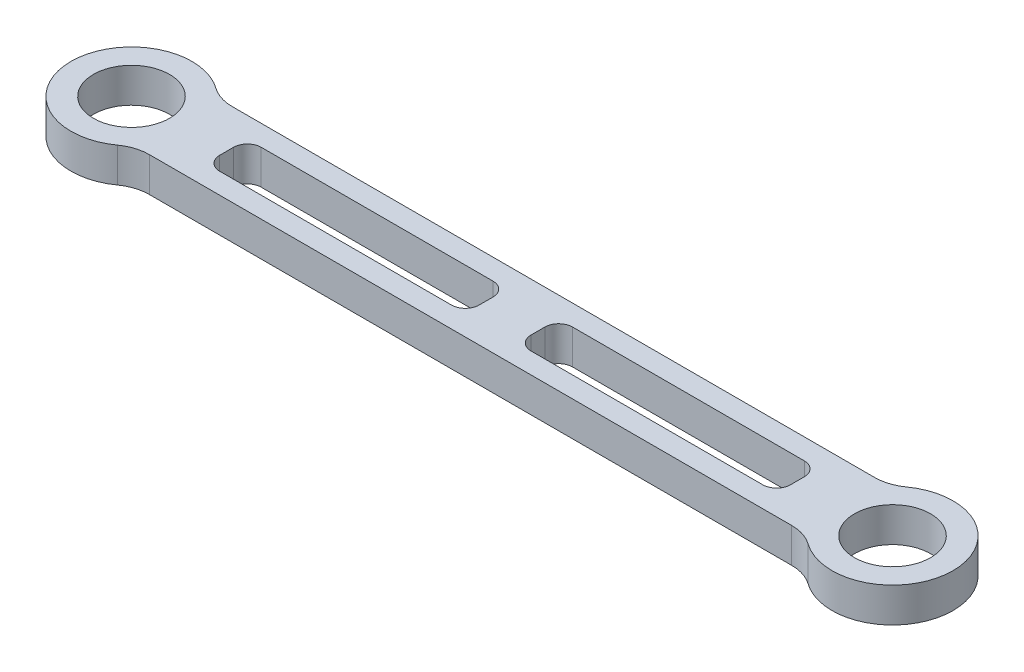
ISO-10303-21;
HEADER;
FILE_DESCRIPTION(('STEP AP214'),'2;1');
FILE_NAME('part.step','',(''),(''),'','','');
FILE_SCHEMA(('AUTOMOTIVE_DESIGN { 1 0 10303 214 1 1 1 1 }'));
ENDSEC;
DATA;
#1=APPLICATION_CONTEXT('core data for automotive mechanical design processes');
#2=APPLICATION_PROTOCOL_DEFINITION('international standard','automotive_design',2000,#1);
#3=PRODUCT_CONTEXT('',#1,'mechanical');
#4=PRODUCT('Part','Part','',(#3));
#5=PRODUCT_RELATED_PRODUCT_CATEGORY('part','',(#4));
#6=PRODUCT_DEFINITION_FORMATION('','',#4);
#7=PRODUCT_DEFINITION_CONTEXT('part definition',#1,'design');
#8=PRODUCT_DEFINITION('design','',#6,#7);
#9=PRODUCT_DEFINITION_SHAPE('','',#8);
#10=(LENGTH_UNIT() NAMED_UNIT(*) SI_UNIT(.MILLI.,.METRE.));
#11=(NAMED_UNIT(*) PLANE_ANGLE_UNIT() SI_UNIT($,.RADIAN.));
#12=(NAMED_UNIT(*) SI_UNIT($,.STERADIAN.) SOLID_ANGLE_UNIT());
#13=UNCERTAINTY_MEASURE_WITH_UNIT(LENGTH_MEASURE(1.E-05),#10,'distance_accuracy_value','');
#14=(GEOMETRIC_REPRESENTATION_CONTEXT(3) GLOBAL_UNCERTAINTY_ASSIGNED_CONTEXT((#13)) GLOBAL_UNIT_ASSIGNED_CONTEXT((#10,
#11,#12)) REPRESENTATION_CONTEXT('',''));
#15=CARTESIAN_POINT('',(0.,0.,0.));
#16=DIRECTION('',(0.,0.,1.));
#17=DIRECTION('',(1.,0.,0.));
#18=AXIS2_PLACEMENT_3D('',#15,#16,#17);
#19=CARTESIAN_POINT('',(0.,10.,-6.));
#20=DIRECTION('',(0.,0.,-1.));
#21=DIRECTION('',(-1.,0.,0.));
#22=AXIS2_PLACEMENT_3D('',#19,#20,#21);
#23=PLANE('',#22);
#24=DIRECTION('',(1.,0.,0.));
#25=VECTOR('',#24,1.);
#26=CARTESIAN_POINT('',(0.,10.,-6.));
#27=LINE('',#26,#25);
#28=CARTESIAN_POINT('',(31.5,10.,-6.));
#29=VERTEX_POINT('',#28);
#30=CARTESIAN_POINT('',(98.5,10.,-6.));
#31=VERTEX_POINT('',#30);
#32=EDGE_CURVE('E386',#29,#31,#27,.T.);
#33=ORIENTED_EDGE('',*,*,#32,.F.);
#34=DIRECTION('',(0.,-1.,0.));
#35=VECTOR('',#34,1.);
#36=CARTESIAN_POINT('',(31.5,10.,-6.));
#37=LINE('',#36,#35);
#38=CARTESIAN_POINT('',(31.5,0.,-6.));
#39=VERTEX_POINT('',#38);
#40=EDGE_CURVE('E281',#29,#39,#37,.T.);
#41=ORIENTED_EDGE('',*,*,#40,.T.);
#42=DIRECTION('',(1.,0.,0.));
#43=VECTOR('',#42,1.);
#44=CARTESIAN_POINT('',(0.,0.,-6.));
#45=LINE('',#44,#43);
#46=CARTESIAN_POINT('',(98.5,0.,-6.));
#47=VERTEX_POINT('',#46);
#48=EDGE_CURVE('E230',#39,#47,#45,.T.);
#49=ORIENTED_EDGE('',*,*,#48,.T.);
#50=DIRECTION('',(0.,-1.,0.));
#51=VECTOR('',#50,1.);
#52=CARTESIAN_POINT('',(98.5,10.,-6.));
#53=LINE('',#52,#51);
#54=EDGE_CURVE('E279',#47,#31,#53,.F.);
#55=ORIENTED_EDGE('',*,*,#54,.T.);
#56=EDGE_LOOP('',(#33,#41,#49,#55));
#57=FACE_BOUND('',#56,.T.);
#58=ADVANCED_FACE('F37',(#57),#23,.F.);
#59=CARTESIAN_POINT('',(102.5,10.,0.));
#60=DIRECTION('',(1.,0.,0.));
#61=DIRECTION('',(0.,0.,-1.));
#62=AXIS2_PLACEMENT_3D('',#59,#60,#61);
#63=PLANE('',#62);
#64=DIRECTION('',(0.,0.,1.));
#65=VECTOR('',#64,1.);
#66=CARTESIAN_POINT('',(102.5,0.,0.));
#67=LINE('',#66,#65);
#68=CARTESIAN_POINT('',(102.5,0.,-2.));
#69=VERTEX_POINT('',#68);
#70=CARTESIAN_POINT('',(102.5,0.,2.));
#71=VERTEX_POINT('',#70);
#72=EDGE_CURVE('E238',#69,#71,#67,.T.);
#73=ORIENTED_EDGE('',*,*,#72,.T.);
#74=DIRECTION('',(0.,-1.,0.));
#75=VECTOR('',#74,1.);
#76=CARTESIAN_POINT('',(102.5,10.,2.));
#77=LINE('',#76,#75);
#78=CARTESIAN_POINT('',(102.5,10.,2.));
#79=VERTEX_POINT('',#78);
#80=EDGE_CURVE('E210',#71,#79,#77,.F.);
#81=ORIENTED_EDGE('',*,*,#80,.T.);
#82=DIRECTION('',(0.,0.,1.));
#83=VECTOR('',#82,1.);
#84=CARTESIAN_POINT('',(102.5,10.,0.));
#85=LINE('',#84,#83);
#86=CARTESIAN_POINT('',(102.5,10.,-2.));
#87=VERTEX_POINT('',#86);
#88=EDGE_CURVE('E389',#87,#79,#85,.T.);
#89=ORIENTED_EDGE('',*,*,#88,.F.);
#90=DIRECTION('',(0.,-1.,0.));
#91=VECTOR('',#90,1.);
#92=CARTESIAN_POINT('',(102.5,0.,-2.));
#93=LINE('',#92,#91);
#94=EDGE_CURVE('E284',#87,#69,#93,.T.);
#95=ORIENTED_EDGE('',*,*,#94,.T.);
#96=EDGE_LOOP('',(#73,#81,#89,#95));
#97=FACE_BOUND('',#96,.T.);
#98=ADVANCED_FACE('F434',(#97),#63,.F.);
#99=CARTESIAN_POINT('',(0.,10.,6.));
#100=DIRECTION('',(0.,0.,-1.));
#101=DIRECTION('',(-1.,0.,0.));
#102=AXIS2_PLACEMENT_3D('',#99,#100,#101);
#103=PLANE('',#102);
#104=DIRECTION('',(1.,0.,0.));
#105=VECTOR('',#104,1.);
#106=CARTESIAN_POINT('',(0.,0.,6.));
#107=LINE('',#106,#105);
#108=CARTESIAN_POINT('',(31.5,0.,6.));
#109=VERTEX_POINT('',#108);
#110=CARTESIAN_POINT('',(98.5,0.,6.));
#111=VERTEX_POINT('',#110);
#112=EDGE_CURVE('E241',#109,#111,#107,.T.);
#113=ORIENTED_EDGE('',*,*,#112,.F.);
#114=DIRECTION('',(0.,-1.,0.));
#115=VECTOR('',#114,1.);
#116=CARTESIAN_POINT('',(31.5,10.,6.));
#117=LINE('',#116,#115);
#118=CARTESIAN_POINT('',(31.5,10.,6.));
#119=VERTEX_POINT('',#118);
#120=EDGE_CURVE('E277',#109,#119,#117,.F.);
#121=ORIENTED_EDGE('',*,*,#120,.T.);
#122=DIRECTION('',(1.,0.,0.));
#123=VECTOR('',#122,1.);
#124=CARTESIAN_POINT('',(0.,10.,6.));
#125=LINE('',#124,#123);
#126=CARTESIAN_POINT('',(98.5,10.,6.));
#127=VERTEX_POINT('',#126);
#128=EDGE_CURVE('E392',#119,#127,#125,.T.);
#129=ORIENTED_EDGE('',*,*,#128,.T.);
#130=DIRECTION('',(0.,-1.,0.));
#131=VECTOR('',#130,1.);
#132=CARTESIAN_POINT('',(98.5,10.,6.));
#133=LINE('',#132,#131);
#134=EDGE_CURVE('E274',#127,#111,#133,.T.);
#135=ORIENTED_EDGE('',*,*,#134,.T.);
#136=EDGE_LOOP('',(#113,#121,#129,#135));
#137=FACE_BOUND('',#136,.T.);
#138=ADVANCED_FACE('F431',(#137),#103,.T.);
#139=CARTESIAN_POINT('',(0.,10.,-6.));
#140=DIRECTION('',(0.,0.,1.));
#141=DIRECTION('',(1.,0.,0.));
#142=AXIS2_PLACEMENT_3D('',#139,#140,#141);
#143=PLANE('',#142);
#144=DIRECTION('',(-1.,0.,0.));
#145=VECTOR('',#144,1.);
#146=CARTESIAN_POINT('',(0.,0.,-6.));
#147=LINE('',#146,#145);
#148=CARTESIAN_POINT('',(188.5,0.,-6.));
#149=VERTEX_POINT('',#148);
#150=CARTESIAN_POINT('',(121.5,0.,-6.));
#151=VERTEX_POINT('',#150);
#152=EDGE_CURVE('E232',#149,#151,#147,.T.);
#153=ORIENTED_EDGE('',*,*,#152,.F.);
#154=DIRECTION('',(0.,-1.,0.));
#155=VECTOR('',#154,1.);
#156=CARTESIAN_POINT('',(188.5,10.,-6.));
#157=LINE('',#156,#155);
#158=CARTESIAN_POINT('',(188.5,10.,-6.));
#159=VERTEX_POINT('',#158);
#160=EDGE_CURVE('E262',#149,#159,#157,.F.);
#161=ORIENTED_EDGE('',*,*,#160,.T.);
#162=DIRECTION('',(-1.,0.,0.));
#163=VECTOR('',#162,1.);
#164=CARTESIAN_POINT('',(0.,10.,-6.));
#165=LINE('',#164,#163);
#166=CARTESIAN_POINT('',(121.5,10.,-6.));
#167=VERTEX_POINT('',#166);
#168=EDGE_CURVE('E376',#159,#167,#165,.T.);
#169=ORIENTED_EDGE('',*,*,#168,.T.);
#170=DIRECTION('',(0.,-1.,0.));
#171=VECTOR('',#170,1.);
#172=CARTESIAN_POINT('',(121.5,0.,-6.));
#173=LINE('',#172,#171);
#174=EDGE_CURVE('E259',#167,#151,#173,.T.);
#175=ORIENTED_EDGE('',*,*,#174,.T.);
#176=EDGE_LOOP('',(#153,#161,#169,#175));
#177=FACE_BOUND('',#176,.T.);
#178=ADVANCED_FACE('F413',(#177),#143,.T.);
#179=CARTESIAN_POINT('',(192.5,10.,0.));
#180=DIRECTION('',(1.,0.,0.));
#181=DIRECTION('',(0.,0.,-1.));
#182=AXIS2_PLACEMENT_3D('',#179,#180,#181);
#183=PLANE('',#182);
#184=DIRECTION('',(0.,0.,1.));
#185=VECTOR('',#184,1.);
#186=CARTESIAN_POINT('',(192.5,0.,0.));
#187=LINE('',#186,#185);
#188=CARTESIAN_POINT('',(192.5,0.,-2.));
#189=VERTEX_POINT('',#188);
#190=CARTESIAN_POINT('',(192.5,0.,2.));
#191=VERTEX_POINT('',#190);
#192=EDGE_CURVE('E228',#189,#191,#187,.T.);
#193=ORIENTED_EDGE('',*,*,#192,.T.);
#194=DIRECTION('',(0.,-1.,0.));
#195=VECTOR('',#194,1.);
#196=CARTESIAN_POINT('',(192.5,10.,2.));
#197=LINE('',#196,#195);
#198=CARTESIAN_POINT('',(192.5,10.,2.));
#199=VERTEX_POINT('',#198);
#200=EDGE_CURVE('E204',#191,#199,#197,.F.);
#201=ORIENTED_EDGE('',*,*,#200,.T.);
#202=DIRECTION('',(0.,0.,1.));
#203=VECTOR('',#202,1.);
#204=CARTESIAN_POINT('',(192.5,10.,0.));
#205=LINE('',#204,#203);
#206=CARTESIAN_POINT('',(192.5,10.,-2.));
#207=VERTEX_POINT('',#206);
#208=EDGE_CURVE('E379',#207,#199,#205,.T.);
#209=ORIENTED_EDGE('',*,*,#208,.F.);
#210=DIRECTION('',(0.,-1.,0.));
#211=VECTOR('',#210,1.);
#212=CARTESIAN_POINT('',(192.5,10.,-2.));
#213=LINE('',#212,#211);
#214=EDGE_CURVE('E220',#207,#189,#213,.T.);
#215=ORIENTED_EDGE('',*,*,#214,.T.);
#216=EDGE_LOOP('',(#193,#201,#209,#215));
#217=FACE_BOUND('',#216,.T.);
#218=ADVANCED_FACE('F423',(#217),#183,.F.);
#219=CARTESIAN_POINT('',(0.,10.,6.));
#220=DIRECTION('',(0.,0.,1.));
#221=DIRECTION('',(1.,0.,0.));
#222=AXIS2_PLACEMENT_3D('',#219,#220,#221);
#223=PLANE('',#222);
#224=DIRECTION('',(-1.,0.,0.));
#225=VECTOR('',#224,1.);
#226=CARTESIAN_POINT('',(0.,10.,6.));
#227=LINE('',#226,#225);
#228=CARTESIAN_POINT('',(188.5,10.,6.));
#229=VERTEX_POINT('',#228);
#230=CARTESIAN_POINT('',(121.5,10.,6.));
#231=VERTEX_POINT('',#230);
#232=EDGE_CURVE('E219',#229,#231,#227,.T.);
#233=ORIENTED_EDGE('',*,*,#232,.F.);
#234=DIRECTION('',(0.,-1.,0.));
#235=VECTOR('',#234,1.);
#236=CARTESIAN_POINT('',(188.5,0.,6.));
#237=LINE('',#236,#235);
#238=CARTESIAN_POINT('',(188.5,0.,6.));
#239=VERTEX_POINT('',#238);
#240=EDGE_CURVE('E203',#229,#239,#237,.T.);
#241=ORIENTED_EDGE('',*,*,#240,.T.);
#242=DIRECTION('',(-1.,0.,0.));
#243=VECTOR('',#242,1.);
#244=CARTESIAN_POINT('',(0.,0.,6.));
#245=LINE('',#244,#243);
#246=CARTESIAN_POINT('',(121.5,0.,6.));
#247=VERTEX_POINT('',#246);
#248=EDGE_CURVE('E216',#239,#247,#245,.T.);
#249=ORIENTED_EDGE('',*,*,#248,.T.);
#250=DIRECTION('',(0.,-1.,0.));
#251=VECTOR('',#250,1.);
#252=CARTESIAN_POINT('',(121.5,10.,6.));
#253=LINE('',#252,#251);
#254=EDGE_CURVE('E221',#247,#231,#253,.F.);
#255=ORIENTED_EDGE('',*,*,#254,.T.);
#256=EDGE_LOOP('',(#233,#241,#249,#255));
#257=FACE_BOUND('',#256,.T.);
#258=ADVANCED_FACE('F215',(#257),#223,.F.);
#259=CARTESIAN_POINT('',(0.,10.,12.));
#260=DIRECTION('',(0.,0.,-1.));
#261=DIRECTION('',(-1.,0.,0.));
#262=AXIS2_PLACEMENT_3D('',#259,#260,#261);
#263=PLANE('',#262);
#264=DIRECTION('',(1.,0.,0.));
#265=VECTOR('',#264,1.);
#266=CARTESIAN_POINT('',(0.,0.,12.));
#267=LINE('',#266,#265);
#268=CARTESIAN_POINT('',(17.1537167984085,0.,12.));
#269=VERTEX_POINT('',#268);
#270=CARTESIAN_POINT('',(202.846283201592,0.,12.));
#271=VERTEX_POINT('',#270);
#272=EDGE_CURVE('E350',#269,#271,#267,.T.);
#273=ORIENTED_EDGE('',*,*,#272,.T.);
#274=DIRECTION('',(0.,1.,0.));
#275=VECTOR('',#274,1.);
#276=CARTESIAN_POINT('',(202.846283201592,10.,12.));
#277=LINE('',#276,#275);
#278=CARTESIAN_POINT('',(202.846283201592,10.,12.));
#279=VERTEX_POINT('',#278);
#280=EDGE_CURVE('E329',#271,#279,#277,.T.);
#281=ORIENTED_EDGE('',*,*,#280,.T.);
#282=DIRECTION('',(1.,0.,0.));
#283=VECTOR('',#282,1.);
#284=CARTESIAN_POINT('',(0.,10.,12.));
#285=LINE('',#284,#283);
#286=CARTESIAN_POINT('',(17.1537167984085,10.,12.));
#287=VERTEX_POINT('',#286);
#288=EDGE_CURVE('E253',#287,#279,#285,.T.);
#289=ORIENTED_EDGE('',*,*,#288,.F.);
#290=DIRECTION('',(0.,1.,0.));
#291=VECTOR('',#290,1.);
#292=CARTESIAN_POINT('',(17.1537167984085,0.,12.));
#293=LINE('',#292,#291);
#294=EDGE_CURVE('E326',#287,#269,#293,.F.);
#295=ORIENTED_EDGE('',*,*,#294,.T.);
#296=EDGE_LOOP('',(#273,#281,#289,#295));
#297=FACE_BOUND('',#296,.T.);
#298=ADVANCED_FACE('F365',(#297),#263,.F.);
#299=CARTESIAN_POINT('',(220.,10.,0.));
#300=DIRECTION('',(0.,-1.,0.));
#301=DIRECTION('',(0.,0.,-1.));
#302=AXIS2_PLACEMENT_3D('',#299,#300,#301);
#303=CYLINDRICAL_SURFACE('',#302,17.5);
#304=CARTESIAN_POINT('',(220.,0.,0.));
#305=DIRECTION('',(0.,1.,0.));
#306=DIRECTION('',(0.,0.,1.));
#307=AXIS2_PLACEMENT_3D('',#304,#305,#306);
#308=CIRCLE('',#307,17.5);
#309=CARTESIAN_POINT('',(209.824066306029,0.,14.2372881355932));
#310=VERTEX_POINT('',#309);
#311=CARTESIAN_POINT('',(209.824066306029,0.,-14.2372881355932));
#312=VERTEX_POINT('',#311);
#313=EDGE_CURVE('E404',#310,#312,#308,.T.);
#314=ORIENTED_EDGE('',*,*,#313,.T.);
#315=DIRECTION('',(0.,-1.,0.));
#316=VECTOR('',#315,1.);
#317=CARTESIAN_POINT('',(209.824066306029,10.,-14.2372881355932));
#318=LINE('',#317,#316);
#319=CARTESIAN_POINT('',(209.824066306029,10.,-14.2372881355932));
#320=VERTEX_POINT('',#319);
#321=EDGE_CURVE('E324',#312,#320,#318,.F.);
#322=ORIENTED_EDGE('',*,*,#321,.T.);
#323=CARTESIAN_POINT('',(220.,10.,0.));
#324=DIRECTION('',(0.,1.,0.));
#325=DIRECTION('',(0.,0.,1.));
#326=AXIS2_PLACEMENT_3D('',#323,#324,#325);
#327=CIRCLE('',#326,17.5);
#328=CARTESIAN_POINT('',(209.824066306029,10.,14.2372881355932));
#329=VERTEX_POINT('',#328);
#330=EDGE_CURVE('E367',#329,#320,#327,.T.);
#331=ORIENTED_EDGE('',*,*,#330,.F.);
#332=DIRECTION('',(0.,-1.,0.));
#333=VECTOR('',#332,1.);
#334=CARTESIAN_POINT('',(209.824066306029,10.,14.2372881355932));
#335=LINE('',#334,#333);
#336=EDGE_CURVE('E321',#329,#310,#335,.T.);
#337=ORIENTED_EDGE('',*,*,#336,.T.);
#338=EDGE_LOOP('',(#314,#322,#331,#337));
#339=FACE_BOUND('',#338,.T.);
#340=ADVANCED_FACE('F515',(#339),#303,.T.);
#341=CARTESIAN_POINT('',(0.,10.,-12.));
#342=DIRECTION('',(0.,0.,-1.));
#343=DIRECTION('',(-1.,0.,0.));
#344=AXIS2_PLACEMENT_3D('',#341,#342,#343);
#345=PLANE('',#344);
#346=DIRECTION('',(1.,0.,0.));
#347=VECTOR('',#346,1.);
#348=CARTESIAN_POINT('',(0.,10.,-12.));
#349=LINE('',#348,#347);
#350=CARTESIAN_POINT('',(17.1537167984085,10.,-12.));
#351=VERTEX_POINT('',#350);
#352=CARTESIAN_POINT('',(202.846283201592,10.,-12.));
#353=VERTEX_POINT('',#352);
#354=EDGE_CURVE('E370',#351,#353,#349,.T.);
#355=ORIENTED_EDGE('',*,*,#354,.T.);
#356=DIRECTION('',(0.,-1.,0.));
#357=VECTOR('',#356,1.);
#358=CARTESIAN_POINT('',(202.846283201592,10.,-12.));
#359=LINE('',#358,#357);
#360=CARTESIAN_POINT('',(202.846283201592,0.,-12.));
#361=VERTEX_POINT('',#360);
#362=EDGE_CURVE('E318',#353,#361,#359,.T.);
#363=ORIENTED_EDGE('',*,*,#362,.T.);
#364=DIRECTION('',(1.,0.,0.));
#365=VECTOR('',#364,1.);
#366=CARTESIAN_POINT('',(0.,0.,-12.));
#367=LINE('',#366,#365);
#368=CARTESIAN_POINT('',(17.1537167984085,0.,-12.));
#369=VERTEX_POINT('',#368);
#370=EDGE_CURVE('E355',#369,#361,#367,.T.);
#371=ORIENTED_EDGE('',*,*,#370,.F.);
#372=DIRECTION('',(0.,-1.,0.));
#373=VECTOR('',#372,1.);
#374=CARTESIAN_POINT('',(17.1537167984085,10.,-12.));
#375=LINE('',#374,#373);
#376=EDGE_CURVE('E316',#369,#351,#375,.F.);
#377=ORIENTED_EDGE('',*,*,#376,.T.);
#378=EDGE_LOOP('',(#355,#363,#371,#377));
#379=FACE_BOUND('',#378,.T.);
#380=ADVANCED_FACE('F509',(#379),#345,.T.);
#381=CARTESIAN_POINT('',(0.,10.,0.));
#382=DIRECTION('',(0.,-1.,0.));
#383=DIRECTION('',(0.,0.,-1.));
#384=AXIS2_PLACEMENT_3D('',#381,#382,#383);
#385=CYLINDRICAL_SURFACE('',#384,11.);
#386=CARTESIAN_POINT('',(0.,10.,0.));
#387=DIRECTION('',(0.,1.,0.));
#388=DIRECTION('',(0.,0.,1.));
#389=AXIS2_PLACEMENT_3D('',#386,#387,#388);
#390=CIRCLE('',#389,11.);
#391=CARTESIAN_POINT('',(0.,10.,11.));
#392=VERTEX_POINT('',#391);
#393=EDGE_CURVE('E398',#392,#392,#390,.T.);
#394=ORIENTED_EDGE('',*,*,#393,.T.);
#395=EDGE_LOOP('',(#394));
#396=FACE_BOUND('',#395,.T.);
#397=CARTESIAN_POINT('',(0.,0.,0.));
#398=DIRECTION('',(0.,1.,0.));
#399=DIRECTION('',(0.,0.,1.));
#400=AXIS2_PLACEMENT_3D('',#397,#398,#399);
#401=CIRCLE('',#400,11.);
#402=CARTESIAN_POINT('',(0.,0.,11.));
#403=VERTEX_POINT('',#402);
#404=EDGE_CURVE('E247',#403,#403,#401,.T.);
#405=ORIENTED_EDGE('',*,*,#404,.F.);
#406=EDGE_LOOP('',(#405));
#407=FACE_BOUND('',#406,.T.);
#408=ADVANCED_FACE('F455',(#396,#407),#385,.F.);
#409=CARTESIAN_POINT('',(27.5,10.,0.));
#410=DIRECTION('',(1.,0.,0.));
#411=DIRECTION('',(0.,0.,-1.));
#412=AXIS2_PLACEMENT_3D('',#409,#410,#411);
#413=PLANE('',#412);
#414=DIRECTION('',(0.,0.,1.));
#415=VECTOR('',#414,1.);
#416=CARTESIAN_POINT('',(27.5,10.,0.));
#417=LINE('',#416,#415);
#418=CARTESIAN_POINT('',(27.5,10.,-2.));
#419=VERTEX_POINT('',#418);
#420=CARTESIAN_POINT('',(27.5,10.,2.));
#421=VERTEX_POINT('',#420);
#422=EDGE_CURVE('E395',#419,#421,#417,.T.);
#423=ORIENTED_EDGE('',*,*,#422,.T.);
#424=DIRECTION('',(0.,-1.,0.));
#425=VECTOR('',#424,1.);
#426=CARTESIAN_POINT('',(27.5,0.,2.));
#427=LINE('',#426,#425);
#428=CARTESIAN_POINT('',(27.5,0.,2.));
#429=VERTEX_POINT('',#428);
#430=EDGE_CURVE('E271',#421,#429,#427,.T.);
#431=ORIENTED_EDGE('',*,*,#430,.T.);
#432=DIRECTION('',(0.,0.,1.));
#433=VECTOR('',#432,1.);
#434=CARTESIAN_POINT('',(27.5,0.,0.));
#435=LINE('',#434,#433);
#436=CARTESIAN_POINT('',(27.5,0.,-2.));
#437=VERTEX_POINT('',#436);
#438=EDGE_CURVE('E244',#437,#429,#435,.T.);
#439=ORIENTED_EDGE('',*,*,#438,.F.);
#440=DIRECTION('',(0.,-1.,0.));
#441=VECTOR('',#440,1.);
#442=CARTESIAN_POINT('',(27.5,10.,-2.));
#443=LINE('',#442,#441);
#444=EDGE_CURVE('E269',#437,#419,#443,.F.);
#445=ORIENTED_EDGE('',*,*,#444,.T.);
#446=EDGE_LOOP('',(#423,#431,#439,#445));
#447=FACE_BOUND('',#446,.T.);
#448=ADVANCED_FACE('F447',(#447),#413,.T.);
#449=CARTESIAN_POINT('',(117.5,10.,0.));
#450=DIRECTION('',(1.,0.,0.));
#451=DIRECTION('',(0.,0.,-1.));
#452=AXIS2_PLACEMENT_3D('',#449,#450,#451);
#453=PLANE('',#452);
#454=DIRECTION('',(0.,0.,1.));
#455=VECTOR('',#454,1.);
#456=CARTESIAN_POINT('',(117.5,10.,0.));
#457=LINE('',#456,#455);
#458=CARTESIAN_POINT('',(117.5,10.,-2.));
#459=VERTEX_POINT('',#458);
#460=CARTESIAN_POINT('',(117.5,10.,2.));
#461=VERTEX_POINT('',#460);
#462=EDGE_CURVE('E383',#459,#461,#457,.T.);
#463=ORIENTED_EDGE('',*,*,#462,.T.);
#464=DIRECTION('',(0.,-1.,0.));
#465=VECTOR('',#464,1.);
#466=CARTESIAN_POINT('',(117.5,10.,2.));
#467=LINE('',#466,#465);
#468=CARTESIAN_POINT('',(117.5,0.,2.));
#469=VERTEX_POINT('',#468);
#470=EDGE_CURVE('E266',#461,#469,#467,.T.);
#471=ORIENTED_EDGE('',*,*,#470,.T.);
#472=DIRECTION('',(0.,0.,1.));
#473=VECTOR('',#472,1.);
#474=CARTESIAN_POINT('',(117.5,0.,0.));
#475=LINE('',#474,#473);
#476=CARTESIAN_POINT('',(117.5,0.,-2.));
#477=VERTEX_POINT('',#476);
#478=EDGE_CURVE('E227',#477,#469,#475,.T.);
#479=ORIENTED_EDGE('',*,*,#478,.F.);
#480=DIRECTION('',(0.,-1.,0.));
#481=VECTOR('',#480,1.);
#482=CARTESIAN_POINT('',(117.5,10.,-2.));
#483=LINE('',#482,#481);
#484=EDGE_CURVE('E264',#477,#459,#483,.F.);
#485=ORIENTED_EDGE('',*,*,#484,.T.);
#486=EDGE_LOOP('',(#463,#471,#479,#485));
#487=FACE_BOUND('',#486,.T.);
#488=ADVANCED_FACE('F445',(#487),#453,.T.);
#489=CARTESIAN_POINT('',(0.,10.,0.));
#490=DIRECTION('',(0.,-1.,0.));
#491=DIRECTION('',(0.,0.,-1.));
#492=AXIS2_PLACEMENT_3D('',#489,#490,#491);
#493=CYLINDRICAL_SURFACE('',#492,17.5);
#494=CARTESIAN_POINT('',(0.,10.,0.));
#495=DIRECTION('',(0.,1.,0.));
#496=DIRECTION('',(0.,0.,1.));
#497=AXIS2_PLACEMENT_3D('',#494,#495,#496);
#498=CIRCLE('',#497,17.5);
#499=CARTESIAN_POINT('',(10.1759336939711,10.,-14.2372881355932));
#500=VERTEX_POINT('',#499);
#501=CARTESIAN_POINT('',(10.1759336939711,10.,14.2372881355932));
#502=VERTEX_POINT('',#501);
#503=EDGE_CURVE('E363',#500,#502,#498,.T.);
#504=ORIENTED_EDGE('',*,*,#503,.F.);
#505=DIRECTION('',(0.,-1.,0.));
#506=VECTOR('',#505,1.);
#507=CARTESIAN_POINT('',(10.1759336939711,10.,-14.2372881355932));
#508=LINE('',#507,#506);
#509=CARTESIAN_POINT('',(10.1759336939711,0.,-14.2372881355932));
#510=VERTEX_POINT('',#509);
#511=EDGE_CURVE('E332',#500,#510,#508,.T.);
#512=ORIENTED_EDGE('',*,*,#511,.T.);
#513=CARTESIAN_POINT('',(0.,0.,0.));
#514=DIRECTION('',(0.,1.,0.));
#515=DIRECTION('',(0.,0.,1.));
#516=AXIS2_PLACEMENT_3D('',#513,#514,#515);
#517=CIRCLE('',#516,17.5);
#518=CARTESIAN_POINT('',(10.1759336939711,0.,14.2372881355932));
#519=VERTEX_POINT('',#518);
#520=EDGE_CURVE('E348',#510,#519,#517,.T.);
#521=ORIENTED_EDGE('',*,*,#520,.T.);
#522=DIRECTION('',(0.,-1.,0.));
#523=VECTOR('',#522,1.);
#524=CARTESIAN_POINT('',(10.1759336939711,10.,14.2372881355932));
#525=LINE('',#524,#523);
#526=EDGE_CURVE('E52',#519,#502,#525,.F.);
#527=ORIENTED_EDGE('',*,*,#526,.T.);
#528=EDGE_LOOP('',(#504,#512,#521,#527));
#529=FACE_BOUND('',#528,.T.);
#530=ADVANCED_FACE('F353',(#529),#493,.T.);
#531=CARTESIAN_POINT('',(220.,10.,0.));
#532=DIRECTION('',(0.,-1.,0.));
#533=DIRECTION('',(0.,0.,-1.));
#534=AXIS2_PLACEMENT_3D('',#531,#532,#533);
#535=CYLINDRICAL_SURFACE('',#534,11.);
#536=CARTESIAN_POINT('',(220.,10.,0.));
#537=DIRECTION('',(0.,1.,0.));
#538=DIRECTION('',(0.,0.,1.));
#539=AXIS2_PLACEMENT_3D('',#536,#537,#538);
#540=CIRCLE('',#539,11.);
#541=CARTESIAN_POINT('',(220.,10.,11.));
#542=VERTEX_POINT('',#541);
#543=EDGE_CURVE('E254',#542,#542,#540,.T.);
#544=ORIENTED_EDGE('',*,*,#543,.T.);
#545=EDGE_LOOP('',(#544));
#546=FACE_BOUND('',#545,.T.);
#547=CARTESIAN_POINT('',(220.,0.,0.));
#548=DIRECTION('',(0.,1.,0.));
#549=DIRECTION('',(0.,0.,1.));
#550=AXIS2_PLACEMENT_3D('',#547,#548,#549);
#551=CIRCLE('',#550,11.);
#552=CARTESIAN_POINT('',(220.,0.,11.));
#553=VERTEX_POINT('',#552);
#554=EDGE_CURVE('E250',#553,#553,#551,.T.);
#555=ORIENTED_EDGE('',*,*,#554,.F.);
#556=EDGE_LOOP('',(#555));
#557=FACE_BOUND('',#556,.T.);
#558=ADVANCED_FACE('F453',(#546,#557),#535,.F.);
#559=CARTESIAN_POINT('',(0.,10.,0.));
#560=DIRECTION('',(0.,1.,0.));
#561=DIRECTION('',(0.,0.,1.));
#562=AXIS2_PLACEMENT_3D('',#559,#560,#561);
#563=PLANE('',#562);
#564=ORIENTED_EDGE('',*,*,#503,.T.);
#565=CARTESIAN_POINT('',(17.1537167984085,10.,24.));
#566=DIRECTION('',(0.,1.,0.));
#567=DIRECTION('',(0.,0.,1.));
#568=AXIS2_PLACEMENT_3D('',#565,#566,#567);
#569=CIRCLE('',#568,12.);
#570=EDGE_CURVE('E11',#502,#287,#569,.F.);
#571=ORIENTED_EDGE('',*,*,#570,.T.);
#572=ORIENTED_EDGE('',*,*,#288,.T.);
#573=CARTESIAN_POINT('',(202.846283201592,10.,24.));
#574=DIRECTION('',(0.,1.,0.));
#575=DIRECTION('',(0.,0.,1.));
#576=AXIS2_PLACEMENT_3D('',#573,#574,#575);
#577=CIRCLE('',#576,12.);
#578=EDGE_CURVE('E341',#279,#329,#577,.F.);
#579=ORIENTED_EDGE('',*,*,#578,.T.);
#580=ORIENTED_EDGE('',*,*,#330,.T.);
#581=CARTESIAN_POINT('',(202.846283201592,10.,-24.));
#582=DIRECTION('',(0.,1.,0.));
#583=DIRECTION('',(0.,0.,1.));
#584=AXIS2_PLACEMENT_3D('',#581,#582,#583);
#585=CIRCLE('',#584,12.);
#586=EDGE_CURVE('E337',#320,#353,#585,.F.);
#587=ORIENTED_EDGE('',*,*,#586,.T.);
#588=ORIENTED_EDGE('',*,*,#354,.F.);
#589=CARTESIAN_POINT('',(17.1537167984085,10.,-24.));
#590=DIRECTION('',(0.,1.,0.));
#591=DIRECTION('',(0.,0.,1.));
#592=AXIS2_PLACEMENT_3D('',#589,#590,#591);
#593=CIRCLE('',#592,12.);
#594=EDGE_CURVE('E59',#351,#500,#593,.F.);
#595=ORIENTED_EDGE('',*,*,#594,.T.);
#596=EDGE_LOOP('',(#564,#571,#572,#579,#580,#587,#588,#595));
#597=FACE_BOUND('',#596,.T.);
#598=ORIENTED_EDGE('',*,*,#168,.F.);
#599=CARTESIAN_POINT('',(188.5,10.,-2.));
#600=DIRECTION('',(0.,1.,0.));
#601=DIRECTION('',(0.,0.,1.));
#602=AXIS2_PLACEMENT_3D('',#599,#600,#601);
#603=CIRCLE('',#602,4.);
#604=EDGE_CURVE('E291',#159,#207,#603,.F.);
#605=ORIENTED_EDGE('',*,*,#604,.T.);
#606=ORIENTED_EDGE('',*,*,#208,.T.);
#607=CARTESIAN_POINT('',(188.5,10.,2.));
#608=DIRECTION('',(0.,1.,0.));
#609=DIRECTION('',(0.,0.,1.));
#610=AXIS2_PLACEMENT_3D('',#607,#608,#609);
#611=CIRCLE('',#610,4.);
#612=EDGE_CURVE('E209',#199,#229,#611,.F.);
#613=ORIENTED_EDGE('',*,*,#612,.T.);
#614=ORIENTED_EDGE('',*,*,#232,.T.);
#615=CARTESIAN_POINT('',(121.5,10.,2.));
#616=DIRECTION('',(0.,1.,0.));
#617=DIRECTION('',(0.,0.,1.));
#618=AXIS2_PLACEMENT_3D('',#615,#616,#617);
#619=CIRCLE('',#618,4.);
#620=EDGE_CURVE('E294',#231,#461,#619,.F.);
#621=ORIENTED_EDGE('',*,*,#620,.T.);
#622=ORIENTED_EDGE('',*,*,#462,.F.);
#623=CARTESIAN_POINT('',(121.5,10.,-2.));
#624=DIRECTION('',(0.,1.,0.));
#625=DIRECTION('',(0.,0.,1.));
#626=AXIS2_PLACEMENT_3D('',#623,#624,#625);
#627=CIRCLE('',#626,4.);
#628=EDGE_CURVE('E298',#459,#167,#627,.F.);
#629=ORIENTED_EDGE('',*,*,#628,.T.);
#630=EDGE_LOOP('',(#598,#605,#606,#613,#614,#621,#622,#629));
#631=FACE_BOUND('',#630,.T.);
#632=ORIENTED_EDGE('',*,*,#422,.F.);
#633=CARTESIAN_POINT('',(31.5,10.,-2.));
#634=DIRECTION('',(0.,1.,0.));
#635=DIRECTION('',(0.,0.,1.));
#636=AXIS2_PLACEMENT_3D('',#633,#634,#635);
#637=CIRCLE('',#636,4.);
#638=EDGE_CURVE('E306',#419,#29,#637,.F.);
#639=ORIENTED_EDGE('',*,*,#638,.T.);
#640=ORIENTED_EDGE('',*,*,#32,.T.);
#641=CARTESIAN_POINT('',(98.5,10.,-2.));
#642=DIRECTION('',(0.,1.,0.));
#643=DIRECTION('',(0.,0.,1.));
#644=AXIS2_PLACEMENT_3D('',#641,#642,#643);
#645=CIRCLE('',#644,4.);
#646=EDGE_CURVE('E314',#31,#87,#645,.F.);
#647=ORIENTED_EDGE('',*,*,#646,.T.);
#648=ORIENTED_EDGE('',*,*,#88,.T.);
#649=CARTESIAN_POINT('',(98.5,10.,2.));
#650=DIRECTION('',(0.,1.,0.));
#651=DIRECTION('',(0.,0.,1.));
#652=AXIS2_PLACEMENT_3D('',#649,#650,#651);
#653=CIRCLE('',#652,4.);
#654=EDGE_CURVE('E310',#79,#127,#653,.F.);
#655=ORIENTED_EDGE('',*,*,#654,.T.);
#656=ORIENTED_EDGE('',*,*,#128,.F.);
#657=CARTESIAN_POINT('',(31.5,10.,2.));
#658=DIRECTION('',(0.,1.,0.));
#659=DIRECTION('',(0.,0.,1.));
#660=AXIS2_PLACEMENT_3D('',#657,#658,#659);
#661=CIRCLE('',#660,4.);
#662=EDGE_CURVE('E302',#119,#421,#661,.F.);
#663=ORIENTED_EDGE('',*,*,#662,.T.);
#664=EDGE_LOOP('',(#632,#639,#640,#647,#648,#655,#656,#663));
#665=FACE_BOUND('',#664,.T.);
#666=ORIENTED_EDGE('',*,*,#393,.F.);
#667=EDGE_LOOP('',(#666));
#668=FACE_BOUND('',#667,.T.);
#669=ORIENTED_EDGE('',*,*,#543,.F.);
#670=EDGE_LOOP('',(#669));
#671=FACE_BOUND('',#670,.T.);
#672=ADVANCED_FACE('F360',(#597,#631,#665,#668,#671),#563,.T.);
#673=CARTESIAN_POINT('',(0.,0.,0.));
#674=DIRECTION('',(0.,1.,0.));
#675=DIRECTION('',(0.,0.,1.));
#676=AXIS2_PLACEMENT_3D('',#673,#674,#675);
#677=PLANE('',#676);
#678=ORIENTED_EDGE('',*,*,#272,.F.);
#679=CARTESIAN_POINT('',(17.1537167984085,0.,24.));
#680=DIRECTION('',(0.,1.,0.));
#681=DIRECTION('',(0.,0.,1.));
#682=AXIS2_PLACEMENT_3D('',#679,#680,#681);
#683=CIRCLE('',#682,12.);
#684=EDGE_CURVE('E45',#269,#519,#683,.T.);
#685=ORIENTED_EDGE('',*,*,#684,.T.);
#686=ORIENTED_EDGE('',*,*,#520,.F.);
#687=CARTESIAN_POINT('',(17.1537167984085,0.,-24.));
#688=DIRECTION('',(0.,1.,0.));
#689=DIRECTION('',(0.,0.,1.));
#690=AXIS2_PLACEMENT_3D('',#687,#688,#689);
#691=CIRCLE('',#690,12.);
#692=EDGE_CURVE('E343',#510,#369,#691,.T.);
#693=ORIENTED_EDGE('',*,*,#692,.T.);
#694=ORIENTED_EDGE('',*,*,#370,.T.);
#695=CARTESIAN_POINT('',(202.846283201592,0.,-24.));
#696=DIRECTION('',(0.,1.,0.));
#697=DIRECTION('',(0.,0.,1.));
#698=AXIS2_PLACEMENT_3D('',#695,#696,#697);
#699=CIRCLE('',#698,12.);
#700=EDGE_CURVE('E335',#361,#312,#699,.T.);
#701=ORIENTED_EDGE('',*,*,#700,.T.);
#702=ORIENTED_EDGE('',*,*,#313,.F.);
#703=CARTESIAN_POINT('',(202.846283201592,0.,24.));
#704=DIRECTION('',(0.,1.,0.));
#705=DIRECTION('',(0.,0.,1.));
#706=AXIS2_PLACEMENT_3D('',#703,#704,#705);
#707=CIRCLE('',#706,12.);
#708=EDGE_CURVE('E339',#310,#271,#707,.T.);
#709=ORIENTED_EDGE('',*,*,#708,.T.);
#710=EDGE_LOOP('',(#678,#685,#686,#693,#694,#701,#702,#709));
#711=FACE_BOUND('',#710,.T.);
#712=ORIENTED_EDGE('',*,*,#192,.F.);
#713=CARTESIAN_POINT('',(188.5,0.,-2.));
#714=DIRECTION('',(0.,1.,0.));
#715=DIRECTION('',(0.,0.,1.));
#716=AXIS2_PLACEMENT_3D('',#713,#714,#715);
#717=CIRCLE('',#716,4.);
#718=EDGE_CURVE('E289',#189,#149,#717,.T.);
#719=ORIENTED_EDGE('',*,*,#718,.T.);
#720=ORIENTED_EDGE('',*,*,#152,.T.);
#721=CARTESIAN_POINT('',(121.5,0.,-2.));
#722=DIRECTION('',(0.,1.,0.));
#723=DIRECTION('',(0.,0.,1.));
#724=AXIS2_PLACEMENT_3D('',#721,#722,#723);
#725=CIRCLE('',#724,4.);
#726=EDGE_CURVE('E296',#151,#477,#725,.T.);
#727=ORIENTED_EDGE('',*,*,#726,.T.);
#728=ORIENTED_EDGE('',*,*,#478,.T.);
#729=CARTESIAN_POINT('',(121.5,0.,2.));
#730=DIRECTION('',(0.,1.,0.));
#731=DIRECTION('',(0.,0.,1.));
#732=AXIS2_PLACEMENT_3D('',#729,#730,#731);
#733=CIRCLE('',#732,4.);
#734=EDGE_CURVE('E226',#469,#247,#733,.T.);
#735=ORIENTED_EDGE('',*,*,#734,.T.);
#736=ORIENTED_EDGE('',*,*,#248,.F.);
#737=CARTESIAN_POINT('',(188.5,0.,2.));
#738=DIRECTION('',(0.,1.,0.));
#739=DIRECTION('',(0.,0.,1.));
#740=AXIS2_PLACEMENT_3D('',#737,#738,#739);
#741=CIRCLE('',#740,4.);
#742=EDGE_CURVE('E199',#239,#191,#741,.T.);
#743=ORIENTED_EDGE('',*,*,#742,.T.);
#744=EDGE_LOOP('',(#712,#719,#720,#727,#728,#735,#736,#743));
#745=FACE_BOUND('',#744,.T.);
#746=ORIENTED_EDGE('',*,*,#48,.F.);
#747=CARTESIAN_POINT('',(31.5,0.,-2.));
#748=DIRECTION('',(0.,1.,0.));
#749=DIRECTION('',(0.,0.,1.));
#750=AXIS2_PLACEMENT_3D('',#747,#748,#749);
#751=CIRCLE('',#750,4.);
#752=EDGE_CURVE('E304',#39,#437,#751,.T.);
#753=ORIENTED_EDGE('',*,*,#752,.T.);
#754=ORIENTED_EDGE('',*,*,#438,.T.);
#755=CARTESIAN_POINT('',(31.5,0.,2.));
#756=DIRECTION('',(0.,1.,0.));
#757=DIRECTION('',(0.,0.,1.));
#758=AXIS2_PLACEMENT_3D('',#755,#756,#757);
#759=CIRCLE('',#758,4.);
#760=EDGE_CURVE('E300',#429,#109,#759,.T.);
#761=ORIENTED_EDGE('',*,*,#760,.T.);
#762=ORIENTED_EDGE('',*,*,#112,.T.);
#763=CARTESIAN_POINT('',(98.5,0.,2.));
#764=DIRECTION('',(0.,1.,0.));
#765=DIRECTION('',(0.,0.,1.));
#766=AXIS2_PLACEMENT_3D('',#763,#764,#765);
#767=CIRCLE('',#766,4.);
#768=EDGE_CURVE('E308',#111,#71,#767,.T.);
#769=ORIENTED_EDGE('',*,*,#768,.T.);
#770=ORIENTED_EDGE('',*,*,#72,.F.);
#771=CARTESIAN_POINT('',(98.5,0.,-2.));
#772=DIRECTION('',(0.,1.,0.));
#773=DIRECTION('',(0.,0.,1.));
#774=AXIS2_PLACEMENT_3D('',#771,#772,#773);
#775=CIRCLE('',#774,4.);
#776=EDGE_CURVE('E312',#69,#47,#775,.T.);
#777=ORIENTED_EDGE('',*,*,#776,.T.);
#778=EDGE_LOOP('',(#746,#753,#754,#761,#762,#769,#770,#777));
#779=FACE_BOUND('',#778,.T.);
#780=ORIENTED_EDGE('',*,*,#404,.T.);
#781=EDGE_LOOP('',(#780));
#782=FACE_BOUND('',#781,.T.);
#783=ORIENTED_EDGE('',*,*,#554,.T.);
#784=EDGE_LOOP('',(#783));
#785=FACE_BOUND('',#784,.T.);
#786=ADVANCED_FACE('F223',(#711,#745,#779,#782,#785),#677,.F.);
#787=CARTESIAN_POINT('',(188.5,10.,2.));
#788=DIRECTION('',(0.,1.,0.));
#789=DIRECTION('',(0.,0.,1.));
#790=AXIS2_PLACEMENT_3D('',#787,#788,#789);
#791=CYLINDRICAL_SURFACE('',#790,4.);
#792=ORIENTED_EDGE('',*,*,#612,.F.);
#793=ORIENTED_EDGE('',*,*,#200,.F.);
#794=ORIENTED_EDGE('',*,*,#742,.F.);
#795=ORIENTED_EDGE('',*,*,#240,.F.);
#796=EDGE_LOOP('',(#792,#793,#794,#795));
#797=FACE_BOUND('',#796,.T.);
#798=ADVANCED_FACE('F202',(#797),#791,.F.);
#799=CARTESIAN_POINT('',(188.5,10.,-2.));
#800=DIRECTION('',(0.,-1.,0.));
#801=DIRECTION('',(0.,0.,-1.));
#802=AXIS2_PLACEMENT_3D('',#799,#800,#801);
#803=CYLINDRICAL_SURFACE('',#802,4.);
#804=ORIENTED_EDGE('',*,*,#604,.F.);
#805=ORIENTED_EDGE('',*,*,#160,.F.);
#806=ORIENTED_EDGE('',*,*,#718,.F.);
#807=ORIENTED_EDGE('',*,*,#214,.F.);
#808=EDGE_LOOP('',(#804,#805,#806,#807));
#809=FACE_BOUND('',#808,.T.);
#810=ADVANCED_FACE('F418',(#809),#803,.F.);
#811=CARTESIAN_POINT('',(121.5,10.,2.));
#812=DIRECTION('',(0.,-1.,0.));
#813=DIRECTION('',(0.,0.,-1.));
#814=AXIS2_PLACEMENT_3D('',#811,#812,#813);
#815=CYLINDRICAL_SURFACE('',#814,4.);
#816=ORIENTED_EDGE('',*,*,#620,.F.);
#817=ORIENTED_EDGE('',*,*,#254,.F.);
#818=ORIENTED_EDGE('',*,*,#734,.F.);
#819=ORIENTED_EDGE('',*,*,#470,.F.);
#820=EDGE_LOOP('',(#816,#817,#818,#819));
#821=FACE_BOUND('',#820,.T.);
#822=ADVANCED_FACE('F464',(#821),#815,.F.);
#823=CARTESIAN_POINT('',(121.5,10.,-2.));
#824=DIRECTION('',(0.,1.,0.));
#825=DIRECTION('',(0.,0.,1.));
#826=AXIS2_PLACEMENT_3D('',#823,#824,#825);
#827=CYLINDRICAL_SURFACE('',#826,4.);
#828=ORIENTED_EDGE('',*,*,#628,.F.);
#829=ORIENTED_EDGE('',*,*,#484,.F.);
#830=ORIENTED_EDGE('',*,*,#726,.F.);
#831=ORIENTED_EDGE('',*,*,#174,.F.);
#832=EDGE_LOOP('',(#828,#829,#830,#831));
#833=FACE_BOUND('',#832,.T.);
#834=ADVANCED_FACE('F466',(#833),#827,.F.);
#835=CARTESIAN_POINT('',(31.5,10.,2.));
#836=DIRECTION('',(0.,1.,0.));
#837=DIRECTION('',(0.,0.,1.));
#838=AXIS2_PLACEMENT_3D('',#835,#836,#837);
#839=CYLINDRICAL_SURFACE('',#838,4.);
#840=ORIENTED_EDGE('',*,*,#662,.F.);
#841=ORIENTED_EDGE('',*,*,#120,.F.);
#842=ORIENTED_EDGE('',*,*,#760,.F.);
#843=ORIENTED_EDGE('',*,*,#430,.F.);
#844=EDGE_LOOP('',(#840,#841,#842,#843));
#845=FACE_BOUND('',#844,.T.);
#846=ADVANCED_FACE('F472',(#845),#839,.F.);
#847=CARTESIAN_POINT('',(31.5,10.,-2.));
#848=DIRECTION('',(0.,-1.,0.));
#849=DIRECTION('',(0.,0.,-1.));
#850=AXIS2_PLACEMENT_3D('',#847,#848,#849);
#851=CYLINDRICAL_SURFACE('',#850,4.);
#852=ORIENTED_EDGE('',*,*,#638,.F.);
#853=ORIENTED_EDGE('',*,*,#444,.F.);
#854=ORIENTED_EDGE('',*,*,#752,.F.);
#855=ORIENTED_EDGE('',*,*,#40,.F.);
#856=EDGE_LOOP('',(#852,#853,#854,#855));
#857=FACE_BOUND('',#856,.T.);
#858=ADVANCED_FACE('F480',(#857),#851,.F.);
#859=CARTESIAN_POINT('',(98.5,10.,2.));
#860=DIRECTION('',(0.,-1.,0.));
#861=DIRECTION('',(0.,0.,-1.));
#862=AXIS2_PLACEMENT_3D('',#859,#860,#861);
#863=CYLINDRICAL_SURFACE('',#862,4.);
#864=ORIENTED_EDGE('',*,*,#654,.F.);
#865=ORIENTED_EDGE('',*,*,#80,.F.);
#866=ORIENTED_EDGE('',*,*,#768,.F.);
#867=ORIENTED_EDGE('',*,*,#134,.F.);
#868=EDGE_LOOP('',(#864,#865,#866,#867));
#869=FACE_BOUND('',#868,.T.);
#870=ADVANCED_FACE('F484',(#869),#863,.F.);
#871=CARTESIAN_POINT('',(98.5,10.,-2.));
#872=DIRECTION('',(0.,1.,0.));
#873=DIRECTION('',(0.,0.,1.));
#874=AXIS2_PLACEMENT_3D('',#871,#872,#873);
#875=CYLINDRICAL_SURFACE('',#874,4.);
#876=ORIENTED_EDGE('',*,*,#646,.F.);
#877=ORIENTED_EDGE('',*,*,#54,.F.);
#878=ORIENTED_EDGE('',*,*,#776,.F.);
#879=ORIENTED_EDGE('',*,*,#94,.F.);
#880=EDGE_LOOP('',(#876,#877,#878,#879));
#881=FACE_BOUND('',#880,.T.);
#882=ADVANCED_FACE('F488',(#881),#875,.F.);
#883=CARTESIAN_POINT('',(202.846283201592,10.,-24.));
#884=DIRECTION('',(0.,-1.,0.));
#885=DIRECTION('',(0.,0.,-1.));
#886=AXIS2_PLACEMENT_3D('',#883,#884,#885);
#887=CYLINDRICAL_SURFACE('',#886,12.);
#888=ORIENTED_EDGE('',*,*,#586,.F.);
#889=ORIENTED_EDGE('',*,*,#321,.F.);
#890=ORIENTED_EDGE('',*,*,#700,.F.);
#891=ORIENTED_EDGE('',*,*,#362,.F.);
#892=EDGE_LOOP('',(#888,#889,#890,#891));
#893=FACE_BOUND('',#892,.T.);
#894=ADVANCED_FACE('F492',(#893),#887,.F.);
#895=CARTESIAN_POINT('',(202.846283201592,10.,24.));
#896=DIRECTION('',(0.,-1.,0.));
#897=DIRECTION('',(0.,0.,-1.));
#898=AXIS2_PLACEMENT_3D('',#895,#896,#897);
#899=CYLINDRICAL_SURFACE('',#898,12.);
#900=ORIENTED_EDGE('',*,*,#578,.F.);
#901=ORIENTED_EDGE('',*,*,#280,.F.);
#902=ORIENTED_EDGE('',*,*,#708,.F.);
#903=ORIENTED_EDGE('',*,*,#336,.F.);
#904=EDGE_LOOP('',(#900,#901,#902,#903));
#905=FACE_BOUND('',#904,.T.);
#906=ADVANCED_FACE('F496',(#905),#899,.F.);
#907=CARTESIAN_POINT('',(17.1537167984085,10.,-24.));
#908=DIRECTION('',(0.,-1.,0.));
#909=DIRECTION('',(0.,0.,-1.));
#910=AXIS2_PLACEMENT_3D('',#907,#908,#909);
#911=CYLINDRICAL_SURFACE('',#910,12.);
#912=ORIENTED_EDGE('',*,*,#594,.F.);
#913=ORIENTED_EDGE('',*,*,#376,.F.);
#914=ORIENTED_EDGE('',*,*,#692,.F.);
#915=ORIENTED_EDGE('',*,*,#511,.F.);
#916=EDGE_LOOP('',(#912,#913,#914,#915));
#917=FACE_BOUND('',#916,.T.);
#918=ADVANCED_FACE('F499',(#917),#911,.F.);
#919=CARTESIAN_POINT('',(17.1537167984085,10.,24.));
#920=DIRECTION('',(0.,-1.,0.));
#921=DIRECTION('',(0.,0.,-1.));
#922=AXIS2_PLACEMENT_3D('',#919,#920,#921);
#923=CYLINDRICAL_SURFACE('',#922,12.);
#924=ORIENTED_EDGE('',*,*,#570,.F.);
#925=ORIENTED_EDGE('',*,*,#526,.F.);
#926=ORIENTED_EDGE('',*,*,#684,.F.);
#927=ORIENTED_EDGE('',*,*,#294,.F.);
#928=EDGE_LOOP('',(#924,#925,#926,#927));
#929=FACE_BOUND('',#928,.T.);
#930=ADVANCED_FACE('F39',(#929),#923,.F.);
#931=CLOSED_SHELL('',(#58,#98,#138,#178,#218,#258,#298,#340,#380,#408,#448,#488,#530,#558,#672,
#786,#798,#810,#822,#834,#846,#858,#870,#882,#894,#906,#918,#930));
#932=MANIFOLD_SOLID_BREP('B2',#931);
#933=ADVANCED_BREP_SHAPE_REPRESENTATION('',(#18,#932),#14);
#934=SHAPE_DEFINITION_REPRESENTATION(#9,#933);
ENDSEC;
END-ISO-10303-21;
